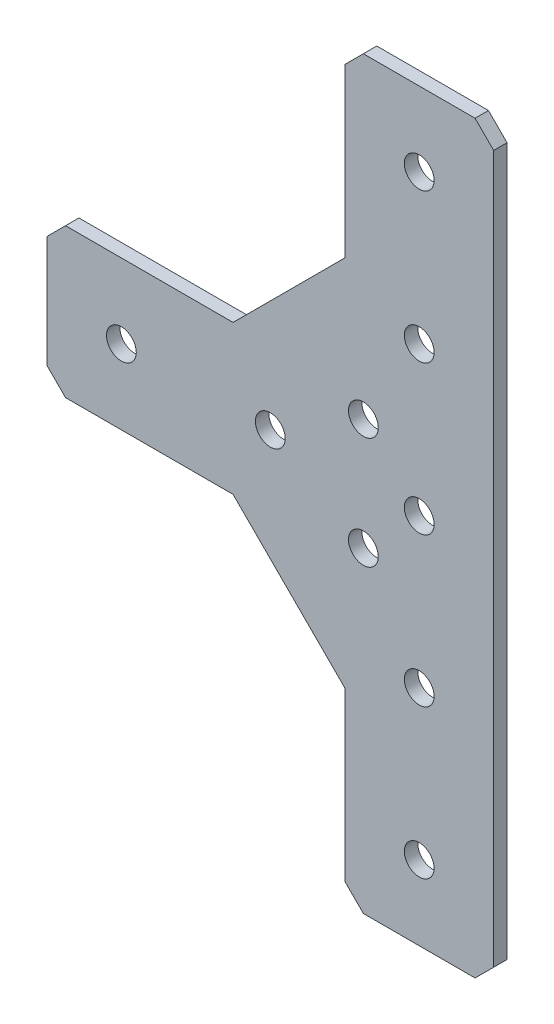
ISO-10303-21;
HEADER;
FILE_DESCRIPTION(('STEP AP214'),'2;1');
FILE_NAME('part.step','',(''),(''),'','','');
FILE_SCHEMA(('AUTOMOTIVE_DESIGN { 1 0 10303 214 1 1 1 1 }'));
ENDSEC;
DATA;
#1=APPLICATION_CONTEXT('core data for automotive mechanical design processes');
#2=APPLICATION_PROTOCOL_DEFINITION('international standard','automotive_design',2000,#1);
#3=PRODUCT_CONTEXT('',#1,'mechanical');
#4=PRODUCT('Part','Part','',(#3));
#5=PRODUCT_RELATED_PRODUCT_CATEGORY('part','',(#4));
#6=PRODUCT_DEFINITION_FORMATION('','',#4);
#7=PRODUCT_DEFINITION_CONTEXT('part definition',#1,'design');
#8=PRODUCT_DEFINITION('design','',#6,#7);
#9=PRODUCT_DEFINITION_SHAPE('','',#8);
#10=(LENGTH_UNIT() NAMED_UNIT(*) SI_UNIT(.MILLI.,.METRE.));
#11=(NAMED_UNIT(*) PLANE_ANGLE_UNIT() SI_UNIT($,.RADIAN.));
#12=(NAMED_UNIT(*) SI_UNIT($,.STERADIAN.) SOLID_ANGLE_UNIT());
#13=UNCERTAINTY_MEASURE_WITH_UNIT(LENGTH_MEASURE(1.E-05),#10,'distance_accuracy_value','');
#14=(GEOMETRIC_REPRESENTATION_CONTEXT(3) GLOBAL_UNCERTAINTY_ASSIGNED_CONTEXT((#13)) GLOBAL_UNIT_ASSIGNED_CONTEXT((#10,
#11,#12)) REPRESENTATION_CONTEXT('',''));
#15=CARTESIAN_POINT('',(0.,0.,0.));
#16=DIRECTION('',(0.,0.,1.));
#17=DIRECTION('',(1.,0.,0.));
#18=AXIS2_PLACEMENT_3D('',#15,#16,#17);
#19=CARTESIAN_POINT('',(0.,0.,-2.286));
#20=DIRECTION('',(0.,0.,1.));
#21=DIRECTION('',(1.,0.,0.));
#22=AXIS2_PLACEMENT_3D('',#19,#20,#21);
#23=PLANE('',#22);
#24=DIRECTION('',(1.,0.,0.));
#25=VECTOR('',#24,1.);
#26=CARTESIAN_POINT('',(-60.325,-12.7000000000002,-2.286));
#27=LINE('',#26,#25);
#28=CARTESIAN_POINT('',(-60.325,-12.7000000000002,-2.286));
#29=VERTEX_POINT('',#28);
#30=CARTESIAN_POINT('',(-31.7500000000002,-12.7000000000002,-2.286));
#31=VERTEX_POINT('',#30);
#32=EDGE_CURVE('E594',#29,#31,#27,.T.);
#33=ORIENTED_EDGE('',*,*,#32,.F.);
#34=DIRECTION('',(0.70710678118655,-0.707106781186545,0.));
#35=VECTOR('',#34,1.);
#36=CARTESIAN_POINT('',(-63.5,-9.52500000000025,-2.286));
#37=LINE('',#36,#35);
#38=CARTESIAN_POINT('',(-63.5,-9.52500000000026,-2.286));
#39=VERTEX_POINT('',#38);
#40=EDGE_CURVE('E591',#39,#29,#37,.T.);
#41=ORIENTED_EDGE('',*,*,#40,.F.);
#42=DIRECTION('',(0.,1.,0.));
#43=VECTOR('',#42,1.);
#44=CARTESIAN_POINT('',(-63.5,9.52499999999969,-2.286));
#45=LINE('',#44,#43);
#46=CARTESIAN_POINT('',(-63.5,9.52499999999969,-2.286));
#47=VERTEX_POINT('',#46);
#48=EDGE_CURVE('E586',#47,#39,#45,.F.);
#49=ORIENTED_EDGE('',*,*,#48,.F.);
#50=DIRECTION('',(-0.707106781186546,-0.707106781186549,0.));
#51=VECTOR('',#50,1.);
#52=CARTESIAN_POINT('',(-60.325,12.6999999999998,-2.286));
#53=LINE('',#52,#51);
#54=CARTESIAN_POINT('',(-60.325,12.6999999999998,-2.286));
#55=VERTEX_POINT('',#54);
#56=EDGE_CURVE('E581',#55,#47,#53,.T.);
#57=ORIENTED_EDGE('',*,*,#56,.F.);
#58=DIRECTION('',(1.,0.,0.));
#59=VECTOR('',#58,1.);
#60=CARTESIAN_POINT('',(-31.7499999999999,12.6999999999998,-2.286));
#61=LINE('',#60,#59);
#62=CARTESIAN_POINT('',(-31.7499999999999,12.6999999999998,-2.286));
#63=VERTEX_POINT('',#62);
#64=EDGE_CURVE('E576',#63,#55,#61,.F.);
#65=ORIENTED_EDGE('',*,*,#64,.F.);
#66=DIRECTION('',(-0.707106781186544,-0.707106781186551,0.));
#67=VECTOR('',#66,1.);
#68=CARTESIAN_POINT('',(-12.7,31.7499999999998,-2.286));
#69=LINE('',#68,#67);
#70=CARTESIAN_POINT('',(-12.7,31.7499999999998,-2.286));
#71=VERTEX_POINT('',#70);
#72=EDGE_CURVE('E571',#71,#63,#69,.T.);
#73=ORIENTED_EDGE('',*,*,#72,.F.);
#74=DIRECTION('',(0.,-1.,0.));
#75=VECTOR('',#74,1.);
#76=CARTESIAN_POINT('',(-12.7,60.3249999999998,-2.286));
#77=LINE('',#76,#75);
#78=CARTESIAN_POINT('',(-12.7,60.3249999999998,-2.286));
#79=VERTEX_POINT('',#78);
#80=EDGE_CURVE('E566',#79,#71,#77,.T.);
#81=ORIENTED_EDGE('',*,*,#80,.F.);
#82=DIRECTION('',(-0.707106781186548,-0.707106781186547,0.));
#83=VECTOR('',#82,1.);
#84=CARTESIAN_POINT('',(-9.525,63.4999999999998,-2.286));
#85=LINE('',#84,#83);
#86=CARTESIAN_POINT('',(-9.525,63.4999999999998,-2.286));
#87=VERTEX_POINT('',#86);
#88=EDGE_CURVE('E561',#87,#79,#85,.T.);
#89=ORIENTED_EDGE('',*,*,#88,.F.);
#90=DIRECTION('',(1.,0.,0.));
#91=VECTOR('',#90,1.);
#92=CARTESIAN_POINT('',(9.52499999999994,63.4999999999998,-2.286));
#93=LINE('',#92,#91);
#94=CARTESIAN_POINT('',(9.52499999999994,63.4999999999998,-2.286));
#95=VERTEX_POINT('',#94);
#96=EDGE_CURVE('E556',#95,#87,#93,.F.);
#97=ORIENTED_EDGE('',*,*,#96,.F.);
#98=DIRECTION('',(-0.707106781186546,0.707106781186549,0.));
#99=VECTOR('',#98,1.);
#100=CARTESIAN_POINT('',(12.7,60.3249999999997,-2.286));
#101=LINE('',#100,#99);
#102=CARTESIAN_POINT('',(12.7,60.3249999999997,-2.286));
#103=VERTEX_POINT('',#102);
#104=EDGE_CURVE('E551',#103,#95,#101,.T.);
#105=ORIENTED_EDGE('',*,*,#104,.F.);
#106=DIRECTION('',(0.,1.,0.));
#107=VECTOR('',#106,1.);
#108=CARTESIAN_POINT('',(12.7000000000001,-60.3250000000002,-2.286));
#109=LINE('',#108,#107);
#110=CARTESIAN_POINT('',(12.7000000000001,-60.3250000000002,-2.286));
#111=VERTEX_POINT('',#110);
#112=EDGE_CURVE('E546',#111,#103,#109,.T.);
#113=ORIENTED_EDGE('',*,*,#112,.F.);
#114=DIRECTION('',(0.707106781186543,0.707106781186552,0.));
#115=VECTOR('',#114,1.);
#116=CARTESIAN_POINT('',(9.52500000000013,-63.5000000000002,-2.286));
#117=LINE('',#116,#115);
#118=CARTESIAN_POINT('',(9.52500000000013,-63.5000000000002,-2.286));
#119=VERTEX_POINT('',#118);
#120=EDGE_CURVE('E532',#119,#111,#117,.T.);
#121=ORIENTED_EDGE('',*,*,#120,.F.);
#122=DIRECTION('',(1.,0.,0.));
#123=VECTOR('',#122,1.);
#124=CARTESIAN_POINT('',(-9.52500000000002,-63.5000000000002,-2.286));
#125=LINE('',#124,#123);
#126=CARTESIAN_POINT('',(-9.52500000000001,-63.5000000000002,-2.286));
#127=VERTEX_POINT('',#126);
#128=EDGE_CURVE('E530',#127,#119,#125,.T.);
#129=ORIENTED_EDGE('',*,*,#128,.F.);
#130=DIRECTION('',(0.707106781186546,-0.707106781186549,0.));
#131=VECTOR('',#130,1.);
#132=CARTESIAN_POINT('',(-12.7,-60.3250000000001,-2.286));
#133=LINE('',#132,#131);
#134=CARTESIAN_POINT('',(-12.7,-60.3250000000001,-2.286));
#135=VERTEX_POINT('',#134);
#136=EDGE_CURVE('E146',#135,#127,#133,.T.);
#137=ORIENTED_EDGE('',*,*,#136,.F.);
#138=DIRECTION('',(0.,1.,0.));
#139=VECTOR('',#138,1.);
#140=CARTESIAN_POINT('',(-12.7,-31.7500000000001,-2.286));
#141=LINE('',#140,#139);
#142=CARTESIAN_POINT('',(-12.7,-31.7500000000001,-2.286));
#143=VERTEX_POINT('',#142);
#144=EDGE_CURVE('E128',#143,#135,#141,.F.);
#145=ORIENTED_EDGE('',*,*,#144,.F.);
#146=DIRECTION('',(0.707106781186552,-0.707106781186543,0.));
#147=VECTOR('',#146,1.);
#148=CARTESIAN_POINT('',(-31.7500000000002,-12.7000000000002,-2.286));
#149=LINE('',#148,#147);
#150=EDGE_CURVE('E133',#31,#143,#149,.T.);
#151=ORIENTED_EDGE('',*,*,#150,.F.);
#152=EDGE_LOOP('',(#33,#41,#49,#57,#65,#73,#81,#89,#97,#105,#113,#121,#129,#137,#145,#151));
#153=FACE_BOUND('',#152,.T.);
#154=CARTESIAN_POINT('',(0.,-50.8000000000002,-2.286));
#155=DIRECTION('',(0.,0.,1.));
#156=DIRECTION('',(1.,0.,0.));
#157=AXIS2_PLACEMENT_3D('',#154,#155,#156);
#158=CIRCLE('',#157,2.54);
#159=CARTESIAN_POINT('',(2.54000000000002,-50.8000000000002,-2.286));
#160=VERTEX_POINT('',#159);
#161=EDGE_CURVE('E142',#160,#160,#158,.T.);
#162=ORIENTED_EDGE('',*,*,#161,.T.);
#163=EDGE_LOOP('',(#162));
#164=FACE_BOUND('',#163,.T.);
#165=CARTESIAN_POINT('',(0.,-25.4000000000002,-2.286));
#166=DIRECTION('',(0.,0.,1.));
#167=DIRECTION('',(1.,0.,0.));
#168=AXIS2_PLACEMENT_3D('',#165,#166,#167);
#169=CIRCLE('',#168,2.54);
#170=CARTESIAN_POINT('',(2.54000000000001,-25.4000000000002,-2.286));
#171=VERTEX_POINT('',#170);
#172=EDGE_CURVE('E187',#171,#171,#169,.T.);
#173=ORIENTED_EDGE('',*,*,#172,.T.);
#174=EDGE_LOOP('',(#173));
#175=FACE_BOUND('',#174,.T.);
#176=CARTESIAN_POINT('',(0.,-1.80411241501588E-13,-2.286));
#177=DIRECTION('',(0.,0.,1.));
#178=DIRECTION('',(1.,0.,0.));
#179=AXIS2_PLACEMENT_3D('',#176,#177,#178);
#180=CIRCLE('',#179,2.54);
#181=CARTESIAN_POINT('',(2.54000000000001,-1.80411241501588E-13,-2.286));
#182=VERTEX_POINT('',#181);
#183=EDGE_CURVE('E190',#182,#182,#180,.T.);
#184=ORIENTED_EDGE('',*,*,#183,.T.);
#185=EDGE_LOOP('',(#184));
#186=FACE_BOUND('',#185,.T.);
#187=CARTESIAN_POINT('',(0.,50.7999999999998,-2.286));
#188=DIRECTION('',(0.,0.,1.));
#189=DIRECTION('',(1.,0.,0.));
#190=AXIS2_PLACEMENT_3D('',#187,#188,#189);
#191=CIRCLE('',#190,2.54);
#192=CARTESIAN_POINT('',(2.54,50.7999999999998,-2.286));
#193=VERTEX_POINT('',#192);
#194=EDGE_CURVE('E193',#193,#193,#191,.T.);
#195=ORIENTED_EDGE('',*,*,#194,.T.);
#196=EDGE_LOOP('',(#195));
#197=FACE_BOUND('',#196,.T.);
#198=CARTESIAN_POINT('',(0.,25.3999999999998,-2.286));
#199=DIRECTION('',(0.,0.,1.));
#200=DIRECTION('',(1.,0.,0.));
#201=AXIS2_PLACEMENT_3D('',#198,#199,#200);
#202=CIRCLE('',#201,2.54);
#203=CARTESIAN_POINT('',(2.54000000000001,25.3999999999998,-2.286));
#204=VERTEX_POINT('',#203);
#205=EDGE_CURVE('E196',#204,#204,#202,.T.);
#206=ORIENTED_EDGE('',*,*,#205,.T.);
#207=EDGE_LOOP('',(#206));
#208=FACE_BOUND('',#207,.T.);
#209=CARTESIAN_POINT('',(-50.8,-1.99493199737333E-13,-2.286));
#210=DIRECTION('',(0.,0.,1.));
#211=DIRECTION('',(1.,0.,0.));
#212=AXIS2_PLACEMENT_3D('',#209,#210,#211);
#213=CIRCLE('',#212,2.53999999999999);
#214=CARTESIAN_POINT('',(-48.26,-1.99493199737333E-13,-2.286));
#215=VERTEX_POINT('',#214);
#216=EDGE_CURVE('E199',#215,#215,#213,.T.);
#217=ORIENTED_EDGE('',*,*,#216,.T.);
#218=EDGE_LOOP('',(#217));
#219=FACE_BOUND('',#218,.T.);
#220=CARTESIAN_POINT('',(-25.4,-1.99493199737333E-13,-2.286));
#221=DIRECTION('',(0.,0.,1.));
#222=DIRECTION('',(1.,0.,0.));
#223=AXIS2_PLACEMENT_3D('',#220,#221,#222);
#224=CIRCLE('',#223,2.53999999999999);
#225=CARTESIAN_POINT('',(-22.86,-1.99493199737333E-13,-2.286));
#226=VERTEX_POINT('',#225);
#227=EDGE_CURVE('E202',#226,#226,#224,.T.);
#228=ORIENTED_EDGE('',*,*,#227,.T.);
#229=EDGE_LOOP('',(#228));
#230=FACE_BOUND('',#229,.T.);
#231=CARTESIAN_POINT('',(-9.525,-9.525,-2.286));
#232=DIRECTION('',(0.,0.,1.));
#233=DIRECTION('',(1.,0.,0.));
#234=AXIS2_PLACEMENT_3D('',#231,#232,#233);
#235=CIRCLE('',#234,2.54);
#236=CARTESIAN_POINT('',(-6.985,-9.525,-2.286));
#237=VERTEX_POINT('',#236);
#238=EDGE_CURVE('E204',#237,#237,#235,.T.);
#239=ORIENTED_EDGE('',*,*,#238,.T.);
#240=EDGE_LOOP('',(#239));
#241=FACE_BOUND('',#240,.T.);
#242=CARTESIAN_POINT('',(-9.525,9.525,-2.286));
#243=DIRECTION('',(0.,0.,1.));
#244=DIRECTION('',(1.,0.,0.));
#245=AXIS2_PLACEMENT_3D('',#242,#243,#244);
#246=CIRCLE('',#245,2.54);
#247=CARTESIAN_POINT('',(-6.985,9.525,-2.286));
#248=VERTEX_POINT('',#247);
#249=EDGE_CURVE('E21',#248,#248,#246,.T.);
#250=ORIENTED_EDGE('',*,*,#249,.T.);
#251=EDGE_LOOP('',(#250));
#252=FACE_BOUND('',#251,.T.);
#253=ADVANCED_FACE('F18',(#153,#164,#175,#186,#197,#208,#219,#230,#241,#252),#23,.F.);
#254=CARTESIAN_POINT('',(-9.525,9.525,-2.286));
#255=DIRECTION('',(0.,0.,1.));
#256=DIRECTION('',(1.,0.,0.));
#257=AXIS2_PLACEMENT_3D('',#254,#255,#256);
#258=CYLINDRICAL_SURFACE('',#257,2.54);
#259=CARTESIAN_POINT('',(-9.525,9.525,0.));
#260=DIRECTION('',(0.,0.,1.));
#261=DIRECTION('',(1.,0.,0.));
#262=AXIS2_PLACEMENT_3D('',#259,#260,#261);
#263=CIRCLE('',#262,2.54);
#264=CARTESIAN_POINT('',(-6.985,9.525,0.));
#265=VERTEX_POINT('',#264);
#266=EDGE_CURVE('E182',#265,#265,#263,.F.);
#267=ORIENTED_EDGE('',*,*,#266,.F.);
#268=EDGE_LOOP('',(#267));
#269=FACE_BOUND('',#268,.T.);
#270=ORIENTED_EDGE('',*,*,#249,.F.);
#271=EDGE_LOOP('',(#270));
#272=FACE_BOUND('',#271,.T.);
#273=ADVANCED_FACE('F212',(#269,#272),#258,.F.);
#274=CARTESIAN_POINT('',(-9.525,-9.525,-2.286));
#275=DIRECTION('',(0.,0.,1.));
#276=DIRECTION('',(1.,0.,0.));
#277=AXIS2_PLACEMENT_3D('',#274,#275,#276);
#278=CYLINDRICAL_SURFACE('',#277,2.54);
#279=CARTESIAN_POINT('',(-9.525,-9.525,0.));
#280=DIRECTION('',(0.,0.,1.));
#281=DIRECTION('',(1.,0.,0.));
#282=AXIS2_PLACEMENT_3D('',#279,#280,#281);
#283=CIRCLE('',#282,2.54);
#284=CARTESIAN_POINT('',(-6.985,-9.525,0.));
#285=VERTEX_POINT('',#284);
#286=EDGE_CURVE('E179',#285,#285,#283,.F.);
#287=ORIENTED_EDGE('',*,*,#286,.F.);
#288=EDGE_LOOP('',(#287));
#289=FACE_BOUND('',#288,.T.);
#290=ORIENTED_EDGE('',*,*,#238,.F.);
#291=EDGE_LOOP('',(#290));
#292=FACE_BOUND('',#291,.T.);
#293=ADVANCED_FACE('F214',(#289,#292),#278,.F.);
#294=CARTESIAN_POINT('',(-25.4,-1.99493199737333E-13,-2.286));
#295=DIRECTION('',(0.,0.,1.));
#296=DIRECTION('',(1.,0.,0.));
#297=AXIS2_PLACEMENT_3D('',#294,#295,#296);
#298=CYLINDRICAL_SURFACE('',#297,2.53999999999999);
#299=CARTESIAN_POINT('',(-25.4,-1.99493199737333E-13,0.));
#300=DIRECTION('',(0.,0.,1.));
#301=DIRECTION('',(1.,0.,0.));
#302=AXIS2_PLACEMENT_3D('',#299,#300,#301);
#303=CIRCLE('',#302,2.53999999999999);
#304=CARTESIAN_POINT('',(-22.86,-1.99493199737333E-13,0.));
#305=VERTEX_POINT('',#304);
#306=EDGE_CURVE('E176',#305,#305,#303,.F.);
#307=ORIENTED_EDGE('',*,*,#306,.F.);
#308=EDGE_LOOP('',(#307));
#309=FACE_BOUND('',#308,.T.);
#310=ORIENTED_EDGE('',*,*,#227,.F.);
#311=EDGE_LOOP('',(#310));
#312=FACE_BOUND('',#311,.T.);
#313=ADVANCED_FACE('F221',(#309,#312),#298,.F.);
#314=CARTESIAN_POINT('',(-50.8,-1.99493199737333E-13,-2.286));
#315=DIRECTION('',(0.,0.,1.));
#316=DIRECTION('',(1.,0.,0.));
#317=AXIS2_PLACEMENT_3D('',#314,#315,#316);
#318=CYLINDRICAL_SURFACE('',#317,2.53999999999999);
#319=CARTESIAN_POINT('',(-50.8,-1.99493199737333E-13,0.));
#320=DIRECTION('',(0.,0.,1.));
#321=DIRECTION('',(1.,0.,0.));
#322=AXIS2_PLACEMENT_3D('',#319,#320,#321);
#323=CIRCLE('',#322,2.53999999999999);
#324=CARTESIAN_POINT('',(-48.26,-1.99493199737333E-13,0.));
#325=VERTEX_POINT('',#324);
#326=EDGE_CURVE('E173',#325,#325,#323,.F.);
#327=ORIENTED_EDGE('',*,*,#326,.F.);
#328=EDGE_LOOP('',(#327));
#329=FACE_BOUND('',#328,.T.);
#330=ORIENTED_EDGE('',*,*,#216,.F.);
#331=EDGE_LOOP('',(#330));
#332=FACE_BOUND('',#331,.T.);
#333=ADVANCED_FACE('F312',(#329,#332),#318,.F.);
#334=CARTESIAN_POINT('',(0.,25.3999999999998,-2.286));
#335=DIRECTION('',(0.,0.,1.));
#336=DIRECTION('',(1.,0.,0.));
#337=AXIS2_PLACEMENT_3D('',#334,#335,#336);
#338=CYLINDRICAL_SURFACE('',#337,2.54);
#339=CARTESIAN_POINT('',(0.,25.3999999999998,0.));
#340=DIRECTION('',(0.,0.,1.));
#341=DIRECTION('',(1.,0.,0.));
#342=AXIS2_PLACEMENT_3D('',#339,#340,#341);
#343=CIRCLE('',#342,2.54);
#344=CARTESIAN_POINT('',(2.54000000000001,25.3999999999998,0.));
#345=VERTEX_POINT('',#344);
#346=EDGE_CURVE('E170',#345,#345,#343,.F.);
#347=ORIENTED_EDGE('',*,*,#346,.F.);
#348=EDGE_LOOP('',(#347));
#349=FACE_BOUND('',#348,.T.);
#350=ORIENTED_EDGE('',*,*,#205,.F.);
#351=EDGE_LOOP('',(#350));
#352=FACE_BOUND('',#351,.T.);
#353=ADVANCED_FACE('F308',(#349,#352),#338,.F.);
#354=CARTESIAN_POINT('',(0.,50.7999999999998,-2.286));
#355=DIRECTION('',(0.,0.,1.));
#356=DIRECTION('',(1.,0.,0.));
#357=AXIS2_PLACEMENT_3D('',#354,#355,#356);
#358=CYLINDRICAL_SURFACE('',#357,2.54);
#359=CARTESIAN_POINT('',(0.,50.7999999999998,0.));
#360=DIRECTION('',(0.,0.,1.));
#361=DIRECTION('',(1.,0.,0.));
#362=AXIS2_PLACEMENT_3D('',#359,#360,#361);
#363=CIRCLE('',#362,2.54);
#364=CARTESIAN_POINT('',(2.54,50.7999999999998,0.));
#365=VERTEX_POINT('',#364);
#366=EDGE_CURVE('E167',#365,#365,#363,.F.);
#367=ORIENTED_EDGE('',*,*,#366,.F.);
#368=EDGE_LOOP('',(#367));
#369=FACE_BOUND('',#368,.T.);
#370=ORIENTED_EDGE('',*,*,#194,.F.);
#371=EDGE_LOOP('',(#370));
#372=FACE_BOUND('',#371,.T.);
#373=ADVANCED_FACE('F304',(#369,#372),#358,.F.);
#374=CARTESIAN_POINT('',(0.,-1.80411241501588E-13,-2.286));
#375=DIRECTION('',(0.,0.,1.));
#376=DIRECTION('',(1.,0.,0.));
#377=AXIS2_PLACEMENT_3D('',#374,#375,#376);
#378=CYLINDRICAL_SURFACE('',#377,2.54);
#379=CARTESIAN_POINT('',(0.,-1.80411241501588E-13,0.));
#380=DIRECTION('',(0.,0.,1.));
#381=DIRECTION('',(1.,0.,0.));
#382=AXIS2_PLACEMENT_3D('',#379,#380,#381);
#383=CIRCLE('',#382,2.54);
#384=CARTESIAN_POINT('',(2.54000000000001,-1.80411241501588E-13,0.));
#385=VERTEX_POINT('',#384);
#386=EDGE_CURVE('E164',#385,#385,#383,.F.);
#387=ORIENTED_EDGE('',*,*,#386,.F.);
#388=EDGE_LOOP('',(#387));
#389=FACE_BOUND('',#388,.T.);
#390=ORIENTED_EDGE('',*,*,#183,.F.);
#391=EDGE_LOOP('',(#390));
#392=FACE_BOUND('',#391,.T.);
#393=ADVANCED_FACE('F300',(#389,#392),#378,.F.);
#394=CARTESIAN_POINT('',(0.,-25.4000000000002,-2.286));
#395=DIRECTION('',(0.,0.,1.));
#396=DIRECTION('',(1.,0.,0.));
#397=AXIS2_PLACEMENT_3D('',#394,#395,#396);
#398=CYLINDRICAL_SURFACE('',#397,2.54);
#399=CARTESIAN_POINT('',(0.,-25.4000000000002,0.));
#400=DIRECTION('',(0.,0.,1.));
#401=DIRECTION('',(1.,0.,0.));
#402=AXIS2_PLACEMENT_3D('',#399,#400,#401);
#403=CIRCLE('',#402,2.54);
#404=CARTESIAN_POINT('',(2.54000000000001,-25.4000000000002,0.));
#405=VERTEX_POINT('',#404);
#406=EDGE_CURVE('E161',#405,#405,#403,.F.);
#407=ORIENTED_EDGE('',*,*,#406,.F.);
#408=EDGE_LOOP('',(#407));
#409=FACE_BOUND('',#408,.T.);
#410=ORIENTED_EDGE('',*,*,#172,.F.);
#411=EDGE_LOOP('',(#410));
#412=FACE_BOUND('',#411,.T.);
#413=ADVANCED_FACE('F296',(#409,#412),#398,.F.);
#414=CARTESIAN_POINT('',(0.,-50.8000000000002,-2.286));
#415=DIRECTION('',(0.,0.,1.));
#416=DIRECTION('',(1.,0.,0.));
#417=AXIS2_PLACEMENT_3D('',#414,#415,#416);
#418=CYLINDRICAL_SURFACE('',#417,2.54);
#419=CARTESIAN_POINT('',(0.,-50.8000000000002,0.));
#420=DIRECTION('',(0.,0.,1.));
#421=DIRECTION('',(1.,0.,0.));
#422=AXIS2_PLACEMENT_3D('',#419,#420,#421);
#423=CIRCLE('',#422,2.54);
#424=CARTESIAN_POINT('',(2.54000000000002,-50.8000000000002,0.));
#425=VERTEX_POINT('',#424);
#426=EDGE_CURVE('E157',#425,#425,#423,.F.);
#427=ORIENTED_EDGE('',*,*,#426,.F.);
#428=EDGE_LOOP('',(#427));
#429=FACE_BOUND('',#428,.T.);
#430=ORIENTED_EDGE('',*,*,#161,.F.);
#431=EDGE_LOOP('',(#430));
#432=FACE_BOUND('',#431,.T.);
#433=ADVANCED_FACE('F293',(#429,#432),#418,.F.);
#434=CARTESIAN_POINT('',(-31.7500000000002,-12.7000000000002,-2.286));
#435=DIRECTION('',(-0.707106781186543,-0.707106781186552,0.));
#436=DIRECTION('',(0.707106781186552,-0.707106781186543,0.));
#437=AXIS2_PLACEMENT_3D('',#434,#435,#436);
#438=PLANE('',#437);
#439=ORIENTED_EDGE('',*,*,#150,.T.);
#440=DIRECTION('',(0.,0.,1.));
#441=VECTOR('',#440,1.);
#442=CARTESIAN_POINT('',(-12.7,-31.7500000000001,-2.286));
#443=LINE('',#442,#441);
#444=CARTESIAN_POINT('',(-12.7,-31.7500000000001,0.));
#445=VERTEX_POINT('',#444);
#446=EDGE_CURVE('E135',#445,#143,#443,.F.);
#447=ORIENTED_EDGE('',*,*,#446,.F.);
#448=DIRECTION('',(0.707106781186552,-0.707106781186543,0.));
#449=VECTOR('',#448,1.);
#450=CARTESIAN_POINT('',(-31.7500000000002,-12.7000000000002,0.));
#451=LINE('',#450,#449);
#452=CARTESIAN_POINT('',(-31.7500000000002,-12.7000000000002,0.));
#453=VERTEX_POINT('',#452);
#454=EDGE_CURVE('E160',#453,#445,#451,.T.);
#455=ORIENTED_EDGE('',*,*,#454,.F.);
#456=DIRECTION('',(0.,0.,1.));
#457=VECTOR('',#456,1.);
#458=CARTESIAN_POINT('',(-31.7500000000002,-12.7000000000002,-2.286));
#459=LINE('',#458,#457);
#460=EDGE_CURVE('E138',#31,#453,#459,.T.);
#461=ORIENTED_EDGE('',*,*,#460,.F.);
#462=EDGE_LOOP('',(#439,#447,#455,#461));
#463=FACE_BOUND('',#462,.T.);
#464=ADVANCED_FACE('F134',(#463),#438,.T.);
#465=CARTESIAN_POINT('',(-12.7,-31.7500000000001,-2.286));
#466=DIRECTION('',(-1.,0.,0.));
#467=DIRECTION('',(0.,0.,1.));
#468=AXIS2_PLACEMENT_3D('',#465,#466,#467);
#469=PLANE('',#468);
#470=ORIENTED_EDGE('',*,*,#144,.T.);
#471=DIRECTION('',(0.,0.,1.));
#472=VECTOR('',#471,1.);
#473=CARTESIAN_POINT('',(-12.7,-60.3250000000001,-2.286));
#474=LINE('',#473,#472);
#475=CARTESIAN_POINT('',(-12.7,-60.3250000000001,0.));
#476=VERTEX_POINT('',#475);
#477=EDGE_CURVE('E148',#476,#135,#474,.F.);
#478=ORIENTED_EDGE('',*,*,#477,.F.);
#479=DIRECTION('',(0.,1.,0.));
#480=VECTOR('',#479,1.);
#481=CARTESIAN_POINT('',(-12.7,0.,0.));
#482=LINE('',#481,#480);
#483=EDGE_CURVE('E152',#445,#476,#482,.F.);
#484=ORIENTED_EDGE('',*,*,#483,.F.);
#485=ORIENTED_EDGE('',*,*,#446,.T.);
#486=EDGE_LOOP('',(#470,#478,#484,#485));
#487=FACE_BOUND('',#486,.T.);
#488=ADVANCED_FACE('F150',(#487),#469,.T.);
#489=CARTESIAN_POINT('',(-12.7,-60.3250000000001,-2.286));
#490=DIRECTION('',(-0.707106781186549,-0.707106781186546,0.));
#491=DIRECTION('',(0.707106781186546,-0.707106781186549,0.));
#492=AXIS2_PLACEMENT_3D('',#489,#490,#491);
#493=PLANE('',#492);
#494=ORIENTED_EDGE('',*,*,#136,.T.);
#495=DIRECTION('',(0.,0.,-1.));
#496=VECTOR('',#495,1.);
#497=CARTESIAN_POINT('',(-9.52500000000002,-63.5000000000002,-2.286));
#498=LINE('',#497,#496);
#499=CARTESIAN_POINT('',(-9.52500000000001,-63.5000000000002,0.));
#500=VERTEX_POINT('',#499);
#501=EDGE_CURVE('E526',#500,#127,#498,.T.);
#502=ORIENTED_EDGE('',*,*,#501,.F.);
#503=DIRECTION('',(0.707106781186545,-0.70710678118655,0.));
#504=VECTOR('',#503,1.);
#505=CARTESIAN_POINT('',(-12.7,-60.3250000000001,0.));
#506=LINE('',#505,#504);
#507=EDGE_CURVE('E599',#476,#500,#506,.T.);
#508=ORIENTED_EDGE('',*,*,#507,.F.);
#509=ORIENTED_EDGE('',*,*,#477,.T.);
#510=EDGE_LOOP('',(#494,#502,#508,#509));
#511=FACE_BOUND('',#510,.T.);
#512=ADVANCED_FACE('F284',(#511),#493,.T.);
#513=CARTESIAN_POINT('',(-9.52500000000002,-63.5000000000002,-2.286));
#514=DIRECTION('',(0.,-1.,0.));
#515=DIRECTION('',(0.,0.,-1.));
#516=AXIS2_PLACEMENT_3D('',#513,#514,#515);
#517=PLANE('',#516);
#518=ORIENTED_EDGE('',*,*,#128,.T.);
#519=DIRECTION('',(0.,0.,1.));
#520=VECTOR('',#519,1.);
#521=CARTESIAN_POINT('',(9.52500000000013,-63.5000000000002,-2.286));
#522=LINE('',#521,#520);
#523=CARTESIAN_POINT('',(9.52500000000013,-63.5000000000002,0.));
#524=VERTEX_POINT('',#523);
#525=EDGE_CURVE('E534',#524,#119,#522,.F.);
#526=ORIENTED_EDGE('',*,*,#525,.F.);
#527=DIRECTION('',(1.,0.,0.));
#528=VECTOR('',#527,1.);
#529=CARTESIAN_POINT('',(0.,-63.5000000000002,0.));
#530=LINE('',#529,#528);
#531=EDGE_CURVE('E537',#500,#524,#530,.T.);
#532=ORIENTED_EDGE('',*,*,#531,.F.);
#533=ORIENTED_EDGE('',*,*,#501,.T.);
#534=EDGE_LOOP('',(#518,#526,#532,#533));
#535=FACE_BOUND('',#534,.T.);
#536=ADVANCED_FACE('F280',(#535),#517,.T.);
#537=CARTESIAN_POINT('',(9.52500000000013,-63.5000000000002,-2.286));
#538=DIRECTION('',(0.707106781186552,-0.707106781186543,0.));
#539=DIRECTION('',(0.707106781186543,0.707106781186552,0.));
#540=AXIS2_PLACEMENT_3D('',#537,#538,#539);
#541=PLANE('',#540);
#542=ORIENTED_EDGE('',*,*,#120,.T.);
#543=DIRECTION('',(0.,0.,1.));
#544=VECTOR('',#543,1.);
#545=CARTESIAN_POINT('',(12.7000000000001,-60.3250000000002,-2.286));
#546=LINE('',#545,#544);
#547=CARTESIAN_POINT('',(12.7000000000001,-60.3250000000002,0.));
#548=VERTEX_POINT('',#547);
#549=EDGE_CURVE('E543',#548,#111,#546,.F.);
#550=ORIENTED_EDGE('',*,*,#549,.F.);
#551=DIRECTION('',(0.707106781186543,0.707106781186552,0.));
#552=VECTOR('',#551,1.);
#553=CARTESIAN_POINT('',(9.52500000000013,-63.5000000000002,0.));
#554=LINE('',#553,#552);
#555=EDGE_CURVE('E602',#524,#548,#554,.T.);
#556=ORIENTED_EDGE('',*,*,#555,.F.);
#557=ORIENTED_EDGE('',*,*,#525,.T.);
#558=EDGE_LOOP('',(#542,#550,#556,#557));
#559=FACE_BOUND('',#558,.T.);
#560=ADVANCED_FACE('F276',(#559),#541,.T.);
#561=CARTESIAN_POINT('',(12.7000000000001,-60.3250000000002,-2.286));
#562=DIRECTION('',(1.,0.,0.));
#563=DIRECTION('',(0.,1.,0.));
#564=AXIS2_PLACEMENT_3D('',#561,#562,#563);
#565=PLANE('',#564);
#566=ORIENTED_EDGE('',*,*,#112,.T.);
#567=DIRECTION('',(0.,0.,1.));
#568=VECTOR('',#567,1.);
#569=CARTESIAN_POINT('',(12.7,60.3249999999997,-2.286));
#570=LINE('',#569,#568);
#571=CARTESIAN_POINT('',(12.7,60.3249999999997,0.));
#572=VERTEX_POINT('',#571);
#573=EDGE_CURVE('E548',#572,#103,#570,.F.);
#574=ORIENTED_EDGE('',*,*,#573,.F.);
#575=DIRECTION('',(0.,1.,0.));
#576=VECTOR('',#575,1.);
#577=CARTESIAN_POINT('',(12.7000000000001,0.,0.));
#578=LINE('',#577,#576);
#579=EDGE_CURVE('E605',#548,#572,#578,.T.);
#580=ORIENTED_EDGE('',*,*,#579,.F.);
#581=ORIENTED_EDGE('',*,*,#549,.T.);
#582=EDGE_LOOP('',(#566,#574,#580,#581));
#583=FACE_BOUND('',#582,.T.);
#584=ADVANCED_FACE('F272',(#583),#565,.T.);
#585=CARTESIAN_POINT('',(12.7,60.3249999999997,-2.286));
#586=DIRECTION('',(0.707106781186549,0.707106781186546,0.));
#587=DIRECTION('',(-0.707106781186546,0.707106781186549,0.));
#588=AXIS2_PLACEMENT_3D('',#585,#586,#587);
#589=PLANE('',#588);
#590=ORIENTED_EDGE('',*,*,#104,.T.);
#591=DIRECTION('',(0.,0.,1.));
#592=VECTOR('',#591,1.);
#593=CARTESIAN_POINT('',(9.52499999999994,63.4999999999998,-2.286));
#594=LINE('',#593,#592);
#595=CARTESIAN_POINT('',(9.52499999999994,63.4999999999998,0.));
#596=VERTEX_POINT('',#595);
#597=EDGE_CURVE('E553',#596,#95,#594,.F.);
#598=ORIENTED_EDGE('',*,*,#597,.F.);
#599=DIRECTION('',(-0.707106781186545,0.70710678118655,0.));
#600=VECTOR('',#599,1.);
#601=CARTESIAN_POINT('',(12.7,60.3249999999997,0.));
#602=LINE('',#601,#600);
#603=EDGE_CURVE('E608',#572,#596,#602,.T.);
#604=ORIENTED_EDGE('',*,*,#603,.F.);
#605=ORIENTED_EDGE('',*,*,#573,.T.);
#606=EDGE_LOOP('',(#590,#598,#604,#605));
#607=FACE_BOUND('',#606,.T.);
#608=ADVANCED_FACE('F268',(#607),#589,.T.);
#609=CARTESIAN_POINT('',(9.52499999999994,63.4999999999998,-2.286));
#610=DIRECTION('',(0.,1.,0.));
#611=DIRECTION('',(0.,0.,1.));
#612=AXIS2_PLACEMENT_3D('',#609,#610,#611);
#613=PLANE('',#612);
#614=ORIENTED_EDGE('',*,*,#96,.T.);
#615=DIRECTION('',(0.,0.,1.));
#616=VECTOR('',#615,1.);
#617=CARTESIAN_POINT('',(-9.525,63.4999999999998,-2.286));
#618=LINE('',#617,#616);
#619=CARTESIAN_POINT('',(-9.525,63.4999999999998,0.));
#620=VERTEX_POINT('',#619);
#621=EDGE_CURVE('E558',#620,#87,#618,.F.);
#622=ORIENTED_EDGE('',*,*,#621,.F.);
#623=DIRECTION('',(1.,0.,0.));
#624=VECTOR('',#623,1.);
#625=CARTESIAN_POINT('',(0.,63.4999999999998,0.));
#626=LINE('',#625,#624);
#627=EDGE_CURVE('E611',#596,#620,#626,.F.);
#628=ORIENTED_EDGE('',*,*,#627,.F.);
#629=ORIENTED_EDGE('',*,*,#597,.T.);
#630=EDGE_LOOP('',(#614,#622,#628,#629));
#631=FACE_BOUND('',#630,.T.);
#632=ADVANCED_FACE('F264',(#631),#613,.T.);
#633=CARTESIAN_POINT('',(-9.525,63.4999999999998,-2.286));
#634=DIRECTION('',(-0.707106781186547,0.707106781186548,0.));
#635=DIRECTION('',(-0.707106781186548,-0.707106781186547,0.));
#636=AXIS2_PLACEMENT_3D('',#633,#634,#635);
#637=PLANE('',#636);
#638=ORIENTED_EDGE('',*,*,#88,.T.);
#639=DIRECTION('',(0.,0.,1.));
#640=VECTOR('',#639,1.);
#641=CARTESIAN_POINT('',(-12.7,60.3249999999998,-2.286));
#642=LINE('',#641,#640);
#643=CARTESIAN_POINT('',(-12.7,60.3249999999998,0.));
#644=VERTEX_POINT('',#643);
#645=EDGE_CURVE('E563',#644,#79,#642,.F.);
#646=ORIENTED_EDGE('',*,*,#645,.F.);
#647=DIRECTION('',(-0.707106781186548,-0.707106781186547,0.));
#648=VECTOR('',#647,1.);
#649=CARTESIAN_POINT('',(-9.525,63.4999999999998,0.));
#650=LINE('',#649,#648);
#651=EDGE_CURVE('E614',#620,#644,#650,.T.);
#652=ORIENTED_EDGE('',*,*,#651,.F.);
#653=ORIENTED_EDGE('',*,*,#621,.T.);
#654=EDGE_LOOP('',(#638,#646,#652,#653));
#655=FACE_BOUND('',#654,.T.);
#656=ADVANCED_FACE('F260',(#655),#637,.T.);
#657=CARTESIAN_POINT('',(-12.7,60.3249999999998,-2.286));
#658=DIRECTION('',(-1.,0.,0.));
#659=DIRECTION('',(0.,-1.,0.));
#660=AXIS2_PLACEMENT_3D('',#657,#658,#659);
#661=PLANE('',#660);
#662=ORIENTED_EDGE('',*,*,#80,.T.);
#663=DIRECTION('',(0.,0.,1.));
#664=VECTOR('',#663,1.);
#665=CARTESIAN_POINT('',(-12.7,31.7499999999998,-2.286));
#666=LINE('',#665,#664);
#667=CARTESIAN_POINT('',(-12.7,31.7499999999998,0.));
#668=VERTEX_POINT('',#667);
#669=EDGE_CURVE('E568',#668,#71,#666,.F.);
#670=ORIENTED_EDGE('',*,*,#669,.F.);
#671=DIRECTION('',(0.,1.,0.));
#672=VECTOR('',#671,1.);
#673=CARTESIAN_POINT('',(-12.7,0.,0.));
#674=LINE('',#673,#672);
#675=EDGE_CURVE('E617',#644,#668,#674,.F.);
#676=ORIENTED_EDGE('',*,*,#675,.F.);
#677=ORIENTED_EDGE('',*,*,#645,.T.);
#678=EDGE_LOOP('',(#662,#670,#676,#677));
#679=FACE_BOUND('',#678,.T.);
#680=ADVANCED_FACE('F256',(#679),#661,.T.);
#681=CARTESIAN_POINT('',(-12.7,31.7499999999998,-2.286));
#682=DIRECTION('',(-0.707106781186551,0.707106781186544,0.));
#683=DIRECTION('',(-0.707106781186544,-0.707106781186551,0.));
#684=AXIS2_PLACEMENT_3D('',#681,#682,#683);
#685=PLANE('',#684);
#686=ORIENTED_EDGE('',*,*,#72,.T.);
#687=DIRECTION('',(0.,0.,1.));
#688=VECTOR('',#687,1.);
#689=CARTESIAN_POINT('',(-31.7499999999999,12.6999999999998,-2.286));
#690=LINE('',#689,#688);
#691=CARTESIAN_POINT('',(-31.7499999999999,12.6999999999998,0.));
#692=VERTEX_POINT('',#691);
#693=EDGE_CURVE('E573',#692,#63,#690,.F.);
#694=ORIENTED_EDGE('',*,*,#693,.F.);
#695=DIRECTION('',(-0.707106781186545,-0.707106781186551,0.));
#696=VECTOR('',#695,1.);
#697=CARTESIAN_POINT('',(-12.7,31.7499999999998,0.));
#698=LINE('',#697,#696);
#699=EDGE_CURVE('E620',#668,#692,#698,.T.);
#700=ORIENTED_EDGE('',*,*,#699,.F.);
#701=ORIENTED_EDGE('',*,*,#669,.T.);
#702=EDGE_LOOP('',(#686,#694,#700,#701));
#703=FACE_BOUND('',#702,.T.);
#704=ADVANCED_FACE('F252',(#703),#685,.T.);
#705=CARTESIAN_POINT('',(-31.7499999999999,12.6999999999998,-2.286));
#706=DIRECTION('',(0.,1.,0.));
#707=DIRECTION('',(0.,0.,1.));
#708=AXIS2_PLACEMENT_3D('',#705,#706,#707);
#709=PLANE('',#708);
#710=ORIENTED_EDGE('',*,*,#64,.T.);
#711=DIRECTION('',(0.,0.,1.));
#712=VECTOR('',#711,1.);
#713=CARTESIAN_POINT('',(-60.325,12.6999999999998,-2.286));
#714=LINE('',#713,#712);
#715=CARTESIAN_POINT('',(-60.325,12.6999999999998,0.));
#716=VERTEX_POINT('',#715);
#717=EDGE_CURVE('E578',#716,#55,#714,.F.);
#718=ORIENTED_EDGE('',*,*,#717,.F.);
#719=DIRECTION('',(1.,0.,0.));
#720=VECTOR('',#719,1.);
#721=CARTESIAN_POINT('',(0.,12.6999999999998,0.));
#722=LINE('',#721,#720);
#723=EDGE_CURVE('E623',#692,#716,#722,.F.);
#724=ORIENTED_EDGE('',*,*,#723,.F.);
#725=ORIENTED_EDGE('',*,*,#693,.T.);
#726=EDGE_LOOP('',(#710,#718,#724,#725));
#727=FACE_BOUND('',#726,.T.);
#728=ADVANCED_FACE('F248',(#727),#709,.T.);
#729=CARTESIAN_POINT('',(-60.325,12.6999999999998,-2.286));
#730=DIRECTION('',(-0.707106781186549,0.707106781186546,0.));
#731=DIRECTION('',(-0.707106781186546,-0.707106781186549,0.));
#732=AXIS2_PLACEMENT_3D('',#729,#730,#731);
#733=PLANE('',#732);
#734=ORIENTED_EDGE('',*,*,#56,.T.);
#735=DIRECTION('',(0.,0.,1.));
#736=VECTOR('',#735,1.);
#737=CARTESIAN_POINT('',(-63.5,9.52499999999969,-2.286));
#738=LINE('',#737,#736);
#739=CARTESIAN_POINT('',(-63.5,9.52499999999969,0.));
#740=VERTEX_POINT('',#739);
#741=EDGE_CURVE('E583',#740,#47,#738,.F.);
#742=ORIENTED_EDGE('',*,*,#741,.F.);
#743=DIRECTION('',(-0.707106781186546,-0.707106781186549,0.));
#744=VECTOR('',#743,1.);
#745=CARTESIAN_POINT('',(-60.325,12.6999999999998,0.));
#746=LINE('',#745,#744);
#747=EDGE_CURVE('E626',#716,#740,#746,.T.);
#748=ORIENTED_EDGE('',*,*,#747,.F.);
#749=ORIENTED_EDGE('',*,*,#717,.T.);
#750=EDGE_LOOP('',(#734,#742,#748,#749));
#751=FACE_BOUND('',#750,.T.);
#752=ADVANCED_FACE('F244',(#751),#733,.T.);
#753=CARTESIAN_POINT('',(-63.5,9.52499999999969,-2.286));
#754=DIRECTION('',(-1.,0.,0.));
#755=DIRECTION('',(0.,0.,1.));
#756=AXIS2_PLACEMENT_3D('',#753,#754,#755);
#757=PLANE('',#756);
#758=ORIENTED_EDGE('',*,*,#48,.T.);
#759=DIRECTION('',(0.,0.,1.));
#760=VECTOR('',#759,1.);
#761=CARTESIAN_POINT('',(-63.5,-9.52500000000025,-2.286));
#762=LINE('',#761,#760);
#763=CARTESIAN_POINT('',(-63.5,-9.52500000000026,0.));
#764=VERTEX_POINT('',#763);
#765=EDGE_CURVE('E588',#764,#39,#762,.F.);
#766=ORIENTED_EDGE('',*,*,#765,.F.);
#767=DIRECTION('',(0.,1.,0.));
#768=VECTOR('',#767,1.);
#769=CARTESIAN_POINT('',(-63.5,0.,0.));
#770=LINE('',#769,#768);
#771=EDGE_CURVE('E629',#740,#764,#770,.F.);
#772=ORIENTED_EDGE('',*,*,#771,.F.);
#773=ORIENTED_EDGE('',*,*,#741,.T.);
#774=EDGE_LOOP('',(#758,#766,#772,#773));
#775=FACE_BOUND('',#774,.T.);
#776=ADVANCED_FACE('F241',(#775),#757,.T.);
#777=CARTESIAN_POINT('',(-63.5,-9.52500000000025,-2.286));
#778=DIRECTION('',(-0.707106781186545,-0.70710678118655,0.));
#779=DIRECTION('',(0.70710678118655,-0.707106781186545,0.));
#780=AXIS2_PLACEMENT_3D('',#777,#778,#779);
#781=PLANE('',#780);
#782=ORIENTED_EDGE('',*,*,#40,.T.);
#783=DIRECTION('',(0.,0.,1.));
#784=VECTOR('',#783,1.);
#785=CARTESIAN_POINT('',(-60.325,-12.7000000000002,-2.286));
#786=LINE('',#785,#784);
#787=CARTESIAN_POINT('',(-60.325,-12.7000000000002,0.));
#788=VERTEX_POINT('',#787);
#789=EDGE_CURVE('E36',#788,#29,#786,.F.);
#790=ORIENTED_EDGE('',*,*,#789,.F.);
#791=DIRECTION('',(0.70710678118655,-0.707106781186545,0.));
#792=VECTOR('',#791,1.);
#793=CARTESIAN_POINT('',(-63.5,-9.52500000000025,0.));
#794=LINE('',#793,#792);
#795=EDGE_CURVE('E27',#764,#788,#794,.T.);
#796=ORIENTED_EDGE('',*,*,#795,.F.);
#797=ORIENTED_EDGE('',*,*,#765,.T.);
#798=EDGE_LOOP('',(#782,#790,#796,#797));
#799=FACE_BOUND('',#798,.T.);
#800=ADVANCED_FACE('F233',(#799),#781,.T.);
#801=CARTESIAN_POINT('',(-60.325,-12.7000000000002,-2.286));
#802=DIRECTION('',(0.,-1.,0.));
#803=DIRECTION('',(1.,0.,0.));
#804=AXIS2_PLACEMENT_3D('',#801,#802,#803);
#805=PLANE('',#804);
#806=ORIENTED_EDGE('',*,*,#32,.T.);
#807=ORIENTED_EDGE('',*,*,#460,.T.);
#808=DIRECTION('',(1.,0.,0.));
#809=VECTOR('',#808,1.);
#810=CARTESIAN_POINT('',(0.,-12.7000000000002,0.));
#811=LINE('',#810,#809);
#812=EDGE_CURVE('E11',#788,#453,#811,.T.);
#813=ORIENTED_EDGE('',*,*,#812,.F.);
#814=ORIENTED_EDGE('',*,*,#789,.T.);
#815=EDGE_LOOP('',(#806,#807,#813,#814));
#816=FACE_BOUND('',#815,.T.);
#817=ADVANCED_FACE('F227',(#816),#805,.T.);
#818=CARTESIAN_POINT('',(0.,0.,0.));
#819=DIRECTION('',(0.,0.,1.));
#820=DIRECTION('',(1.,0.,0.));
#821=AXIS2_PLACEMENT_3D('',#818,#819,#820);
#822=PLANE('',#821);
#823=ORIENTED_EDGE('',*,*,#795,.T.);
#824=ORIENTED_EDGE('',*,*,#812,.T.);
#825=ORIENTED_EDGE('',*,*,#454,.T.);
#826=ORIENTED_EDGE('',*,*,#483,.T.);
#827=ORIENTED_EDGE('',*,*,#507,.T.);
#828=ORIENTED_EDGE('',*,*,#531,.T.);
#829=ORIENTED_EDGE('',*,*,#555,.T.);
#830=ORIENTED_EDGE('',*,*,#579,.T.);
#831=ORIENTED_EDGE('',*,*,#603,.T.);
#832=ORIENTED_EDGE('',*,*,#627,.T.);
#833=ORIENTED_EDGE('',*,*,#651,.T.);
#834=ORIENTED_EDGE('',*,*,#675,.T.);
#835=ORIENTED_EDGE('',*,*,#699,.T.);
#836=ORIENTED_EDGE('',*,*,#723,.T.);
#837=ORIENTED_EDGE('',*,*,#747,.T.);
#838=ORIENTED_EDGE('',*,*,#771,.T.);
#839=EDGE_LOOP('',(#823,#824,#825,#826,#827,#828,#829,#830,#831,#832,#833,#834,#835,#836,#837,#838));
#840=FACE_BOUND('',#839,.T.);
#841=ORIENTED_EDGE('',*,*,#426,.T.);
#842=EDGE_LOOP('',(#841));
#843=FACE_BOUND('',#842,.T.);
#844=ORIENTED_EDGE('',*,*,#406,.T.);
#845=EDGE_LOOP('',(#844));
#846=FACE_BOUND('',#845,.T.);
#847=ORIENTED_EDGE('',*,*,#386,.T.);
#848=EDGE_LOOP('',(#847));
#849=FACE_BOUND('',#848,.T.);
#850=ORIENTED_EDGE('',*,*,#366,.T.);
#851=EDGE_LOOP('',(#850));
#852=FACE_BOUND('',#851,.T.);
#853=ORIENTED_EDGE('',*,*,#346,.T.);
#854=EDGE_LOOP('',(#853));
#855=FACE_BOUND('',#854,.T.);
#856=ORIENTED_EDGE('',*,*,#326,.T.);
#857=EDGE_LOOP('',(#856));
#858=FACE_BOUND('',#857,.T.);
#859=ORIENTED_EDGE('',*,*,#306,.T.);
#860=EDGE_LOOP('',(#859));
#861=FACE_BOUND('',#860,.T.);
#862=ORIENTED_EDGE('',*,*,#286,.T.);
#863=EDGE_LOOP('',(#862));
#864=FACE_BOUND('',#863,.T.);
#865=ORIENTED_EDGE('',*,*,#266,.T.);
#866=EDGE_LOOP('',(#865));
#867=FACE_BOUND('',#866,.T.);
#868=ADVANCED_FACE('F225',(#840,#843,#846,#849,#852,#855,#858,#861,#864,#867),#822,.T.);
#869=CLOSED_SHELL('',(#253,#273,#293,#313,#333,#353,#373,#393,#413,#433,#464,#488,#512,#536,
#560,#584,#608,#632,#656,#680,#704,#728,#752,#776,#800,#817,#868));
#870=MANIFOLD_SOLID_BREP('B1',#869);
#871=ADVANCED_BREP_SHAPE_REPRESENTATION('',(#18,#870),#14);
#872=SHAPE_DEFINITION_REPRESENTATION(#9,#871);
ENDSEC;
END-ISO-10303-21;
